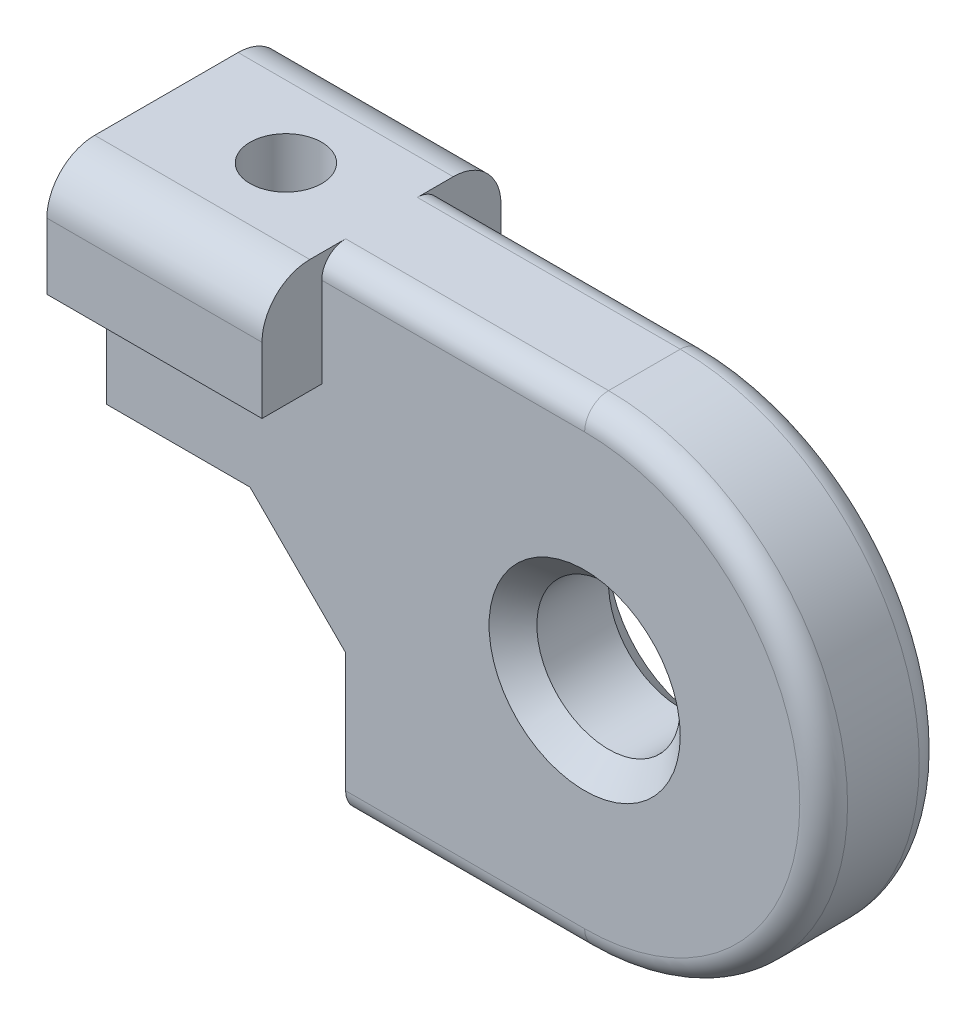
ISO-10303-21;
HEADER;
FILE_DESCRIPTION(('STEP AP214'),'2;1');
FILE_NAME('part.step','',(''),(''),'','','');
FILE_SCHEMA(('AUTOMOTIVE_DESIGN { 1 0 10303 214 1 1 1 1 }'));
ENDSEC;
DATA;
#1=APPLICATION_CONTEXT('core data for automotive mechanical design processes');
#2=APPLICATION_PROTOCOL_DEFINITION('international standard','automotive_design',2000,#1);
#3=PRODUCT_CONTEXT('',#1,'mechanical');
#4=PRODUCT('Part','Part','',(#3));
#5=PRODUCT_RELATED_PRODUCT_CATEGORY('part','',(#4));
#6=PRODUCT_DEFINITION_FORMATION('','',#4);
#7=PRODUCT_DEFINITION_CONTEXT('part definition',#1,'design');
#8=PRODUCT_DEFINITION('design','',#6,#7);
#9=PRODUCT_DEFINITION_SHAPE('','',#8);
#10=(LENGTH_UNIT() NAMED_UNIT(*) SI_UNIT(.MILLI.,.METRE.));
#11=(NAMED_UNIT(*) PLANE_ANGLE_UNIT() SI_UNIT($,.RADIAN.));
#12=(NAMED_UNIT(*) SI_UNIT($,.STERADIAN.) SOLID_ANGLE_UNIT());
#13=UNCERTAINTY_MEASURE_WITH_UNIT(LENGTH_MEASURE(1.E-05),#10,'distance_accuracy_value','');
#14=(GEOMETRIC_REPRESENTATION_CONTEXT(3) GLOBAL_UNCERTAINTY_ASSIGNED_CONTEXT((#13)) GLOBAL_UNIT_ASSIGNED_CONTEXT((#10,
#11,#12)) REPRESENTATION_CONTEXT('',''));
#15=CARTESIAN_POINT('',(0.,0.,0.));
#16=DIRECTION('',(0.,0.,1.));
#17=DIRECTION('',(1.,0.,0.));
#18=AXIS2_PLACEMENT_3D('',#15,#16,#17);
#19=CARTESIAN_POINT('',(0.,0.,2.5));
#20=DIRECTION('',(0.,0.,1.));
#21=DIRECTION('',(1.,0.,0.));
#22=AXIS2_PLACEMENT_3D('',#19,#20,#21);
#23=PLANE('',#22);
#24=DIRECTION('',(0.,-1.,0.));
#25=VECTOR('',#24,1.);
#26=CARTESIAN_POINT('',(-10.,-4.,2.5));
#27=LINE('',#26,#25);
#28=CARTESIAN_POINT('',(-10.,-4.,2.5));
#29=VERTEX_POINT('',#28);
#30=CARTESIAN_POINT('',(-10.,-9.,2.5));
#31=VERTEX_POINT('',#30);
#32=EDGE_CURVE('E297',#29,#31,#27,.T.);
#33=ORIENTED_EDGE('',*,*,#32,.T.);
#34=DIRECTION('',(1.,0.,0.));
#35=VECTOR('',#34,1.);
#36=CARTESIAN_POINT('',(0.,-9.,2.5));
#37=LINE('',#36,#35);
#38=CARTESIAN_POINT('',(0.,-9.,2.5));
#39=VERTEX_POINT('',#38);
#40=EDGE_CURVE('E247',#31,#39,#37,.T.);
#41=ORIENTED_EDGE('',*,*,#40,.T.);
#42=CARTESIAN_POINT('',(0.,0.,2.5));
#43=DIRECTION('',(0.,0.,1.));
#44=DIRECTION('',(1.,0.,0.));
#45=AXIS2_PLACEMENT_3D('',#42,#43,#44);
#46=CIRCLE('',#45,9.);
#47=CARTESIAN_POINT('',(0.,9.,2.5));
#48=VERTEX_POINT('',#47);
#49=EDGE_CURVE('E56',#39,#48,#46,.T.);
#50=ORIENTED_EDGE('',*,*,#49,.T.);
#51=DIRECTION('',(-1.,0.,0.));
#52=VECTOR('',#51,1.);
#53=CARTESIAN_POINT('',(-11.,9.,2.5));
#54=LINE('',#53,#52);
#55=CARTESIAN_POINT('',(-11.,9.,2.5));
#56=VERTEX_POINT('',#55);
#57=EDGE_CURVE('E245',#48,#56,#54,.T.);
#58=ORIENTED_EDGE('',*,*,#57,.T.);
#59=DIRECTION('',(0.,-1.,0.));
#60=VECTOR('',#59,1.);
#61=CARTESIAN_POINT('',(-11.,0.,2.5));
#62=LINE('',#61,#60);
#63=CARTESIAN_POINT('',(-11.,5.23809523809524,2.5));
#64=VERTEX_POINT('',#63);
#65=EDGE_CURVE('E275',#56,#64,#62,.T.);
#66=ORIENTED_EDGE('',*,*,#65,.T.);
#67=DIRECTION('',(-1.,0.,0.));
#68=VECTOR('',#67,1.);
#69=CARTESIAN_POINT('',(0.,5.23809523809524,2.5));
#70=LINE('',#69,#68);
#71=CARTESIAN_POINT('',(-20.,5.23809523809524,2.5));
#72=VERTEX_POINT('',#71);
#73=EDGE_CURVE('E289',#64,#72,#70,.T.);
#74=ORIENTED_EDGE('',*,*,#73,.T.);
#75=DIRECTION('',(0.,-1.,0.));
#76=VECTOR('',#75,1.);
#77=CARTESIAN_POINT('',(-20.,10.,2.5));
#78=LINE('',#77,#76);
#79=CARTESIAN_POINT('',(-20.,0.,2.5));
#80=VERTEX_POINT('',#79);
#81=EDGE_CURVE('E299',#72,#80,#78,.T.);
#82=ORIENTED_EDGE('',*,*,#81,.T.);
#83=DIRECTION('',(1.,0.,0.));
#84=VECTOR('',#83,1.);
#85=CARTESIAN_POINT('',(-20.,0.,2.5));
#86=LINE('',#85,#84);
#87=CARTESIAN_POINT('',(-14.,0.,2.5));
#88=VERTEX_POINT('',#87);
#89=EDGE_CURVE('E293',#80,#88,#86,.T.);
#90=ORIENTED_EDGE('',*,*,#89,.T.);
#91=DIRECTION('',(0.707106781186548,-0.707106781186548,0.));
#92=VECTOR('',#91,1.);
#93=CARTESIAN_POINT('',(-14.,0.,2.5));
#94=LINE('',#93,#92);
#95=EDGE_CURVE('E187',#88,#29,#94,.T.);
#96=ORIENTED_EDGE('',*,*,#95,.T.);
#97=EDGE_LOOP('',(#33,#41,#50,#58,#66,#74,#82,#90,#96));
#98=FACE_BOUND('',#97,.T.);
#99=CARTESIAN_POINT('',(0.,0.,2.5));
#100=DIRECTION('',(0.,0.,1.));
#101=DIRECTION('',(1.,0.,0.));
#102=AXIS2_PLACEMENT_3D('',#99,#100,#101);
#103=CIRCLE('',#102,4.00000000000001);
#104=CARTESIAN_POINT('',(4.00000000000001,0.,2.5));
#105=VERTEX_POINT('',#104);
#106=EDGE_CURVE('E221',#105,#105,#103,.F.);
#107=ORIENTED_EDGE('',*,*,#106,.T.);
#108=EDGE_LOOP('',(#107));
#109=FACE_BOUND('',#108,.T.);
#110=ADVANCED_FACE('F32',(#98,#109),#23,.T.);
#111=CARTESIAN_POINT('',(0.,0.,-2.5));
#112=DIRECTION('',(0.,0.,1.));
#113=DIRECTION('',(1.,0.,0.));
#114=AXIS2_PLACEMENT_3D('',#111,#112,#113);
#115=PLANE('',#114);
#116=CARTESIAN_POINT('',(0.,0.,-2.5));
#117=DIRECTION('',(0.,0.,1.));
#118=DIRECTION('',(1.,0.,0.));
#119=AXIS2_PLACEMENT_3D('',#116,#117,#118);
#120=CIRCLE('',#119,3.99999999999999);
#121=CARTESIAN_POINT('',(3.99999999999999,0.,-2.5));
#122=VERTEX_POINT('',#121);
#123=EDGE_CURVE('E212',#122,#122,#120,.T.);
#124=ORIENTED_EDGE('',*,*,#123,.T.);
#125=EDGE_LOOP('',(#124));
#126=FACE_BOUND('',#125,.T.);
#127=CARTESIAN_POINT('',(0.,0.,-2.5));
#128=DIRECTION('',(0.,0.,1.));
#129=DIRECTION('',(1.,0.,0.));
#130=AXIS2_PLACEMENT_3D('',#127,#128,#129);
#131=CIRCLE('',#130,9.);
#132=CARTESIAN_POINT('',(0.,9.,-2.5));
#133=VERTEX_POINT('',#132);
#134=CARTESIAN_POINT('',(0.,-9.,-2.5));
#135=VERTEX_POINT('',#134);
#136=EDGE_CURVE('E229',#133,#135,#131,.F.);
#137=ORIENTED_EDGE('',*,*,#136,.T.);
#138=DIRECTION('',(1.,0.,0.));
#139=VECTOR('',#138,1.);
#140=CARTESIAN_POINT('',(0.,-9.,-2.5));
#141=LINE('',#140,#139);
#142=CARTESIAN_POINT('',(-10.,-9.,-2.5));
#143=VERTEX_POINT('',#142);
#144=EDGE_CURVE('E233',#135,#143,#141,.F.);
#145=ORIENTED_EDGE('',*,*,#144,.T.);
#146=DIRECTION('',(0.,-1.,0.));
#147=VECTOR('',#146,1.);
#148=CARTESIAN_POINT('',(-10.,-4.,-2.5));
#149=LINE('',#148,#147);
#150=CARTESIAN_POINT('',(-10.,-4.,-2.5));
#151=VERTEX_POINT('',#150);
#152=EDGE_CURVE('E303',#151,#143,#149,.T.);
#153=ORIENTED_EDGE('',*,*,#152,.F.);
#154=DIRECTION('',(0.707106781186548,-0.707106781186548,0.));
#155=VECTOR('',#154,1.);
#156=CARTESIAN_POINT('',(-14.,0.,-2.5));
#157=LINE('',#156,#155);
#158=CARTESIAN_POINT('',(-14.,0.,-2.5));
#159=VERTEX_POINT('',#158);
#160=EDGE_CURVE('E287',#159,#151,#157,.T.);
#161=ORIENTED_EDGE('',*,*,#160,.F.);
#162=DIRECTION('',(1.,0.,0.));
#163=VECTOR('',#162,1.);
#164=CARTESIAN_POINT('',(-20.,0.,-2.5));
#165=LINE('',#164,#163);
#166=CARTESIAN_POINT('',(-20.,0.,-2.5));
#167=VERTEX_POINT('',#166);
#168=EDGE_CURVE('E284',#167,#159,#165,.T.);
#169=ORIENTED_EDGE('',*,*,#168,.F.);
#170=DIRECTION('',(0.,-1.,0.));
#171=VECTOR('',#170,1.);
#172=CARTESIAN_POINT('',(-20.,10.,-2.5));
#173=LINE('',#172,#171);
#174=CARTESIAN_POINT('',(-20.,5.23809523809524,-2.5));
#175=VERTEX_POINT('',#174);
#176=EDGE_CURVE('E295',#175,#167,#173,.T.);
#177=ORIENTED_EDGE('',*,*,#176,.F.);
#178=DIRECTION('',(-1.,0.,0.));
#179=VECTOR('',#178,1.);
#180=CARTESIAN_POINT('',(0.,5.23809523809524,-2.5));
#181=LINE('',#180,#179);
#182=CARTESIAN_POINT('',(-11.,5.23809523809524,-2.5));
#183=VERTEX_POINT('',#182);
#184=EDGE_CURVE('E361',#183,#175,#181,.T.);
#185=ORIENTED_EDGE('',*,*,#184,.F.);
#186=DIRECTION('',(0.,-1.,0.));
#187=VECTOR('',#186,1.);
#188=CARTESIAN_POINT('',(-11.,0.,-2.5));
#189=LINE('',#188,#187);
#190=CARTESIAN_POINT('',(-11.,9.,-2.5));
#191=VERTEX_POINT('',#190);
#192=EDGE_CURVE('E285',#191,#183,#189,.T.);
#193=ORIENTED_EDGE('',*,*,#192,.F.);
#194=DIRECTION('',(-1.,0.,0.));
#195=VECTOR('',#194,1.);
#196=CARTESIAN_POINT('',(0.,9.,-2.5));
#197=LINE('',#196,#195);
#198=EDGE_CURVE('E231',#191,#133,#197,.F.);
#199=ORIENTED_EDGE('',*,*,#198,.T.);
#200=EDGE_LOOP('',(#137,#145,#153,#161,#169,#177,#185,#193,#199));
#201=FACE_BOUND('',#200,.T.);
#202=ADVANCED_FACE('F330',(#126,#201),#115,.F.);
#203=CARTESIAN_POINT('',(-20.,0.,2.5));
#204=DIRECTION('',(0.,1.,0.));
#205=DIRECTION('',(0.,0.,1.));
#206=AXIS2_PLACEMENT_3D('',#203,#204,#205);
#207=PLANE('',#206);
#208=DIRECTION('',(0.,0.,-1.));
#209=VECTOR('',#208,1.);
#210=CARTESIAN_POINT('',(-14.,0.,2.5));
#211=LINE('',#210,#209);
#212=CARTESIAN_POINT('',(-14.,0.,-1.1180339887499));
#213=VERTEX_POINT('',#212);
#214=EDGE_CURVE('E182',#213,#159,#211,.T.);
#215=ORIENTED_EDGE('',*,*,#214,.F.);
#216=CARTESIAN_POINT('',(-15.,0.,0.));
#217=DIRECTION('',(0.,1.,0.));
#218=DIRECTION('',(0.,0.,1.));
#219=AXIS2_PLACEMENT_3D('',#216,#217,#218);
#220=CIRCLE('',#219,1.5);
#221=CARTESIAN_POINT('',(-14.,0.,1.1180339887499));
#222=VERTEX_POINT('',#221);
#223=EDGE_CURVE('E48',#213,#222,#220,.T.);
#224=ORIENTED_EDGE('',*,*,#223,.T.);
#225=EDGE_CURVE('E180',#88,#222,#211,.T.);
#226=ORIENTED_EDGE('',*,*,#225,.F.);
#227=ORIENTED_EDGE('',*,*,#89,.F.);
#228=DIRECTION('',(0.,0.,-1.));
#229=VECTOR('',#228,1.);
#230=CARTESIAN_POINT('',(-20.,0.,2.5));
#231=LINE('',#230,#229);
#232=EDGE_CURVE('E300',#80,#167,#231,.T.);
#233=ORIENTED_EDGE('',*,*,#232,.T.);
#234=ORIENTED_EDGE('',*,*,#168,.T.);
#235=EDGE_LOOP('',(#215,#224,#226,#227,#233,#234));
#236=FACE_BOUND('',#235,.T.);
#237=ADVANCED_FACE('F178',(#236),#207,.F.);
#238=CARTESIAN_POINT('',(-14.,0.,2.5));
#239=DIRECTION('',(0.707106781186548,0.707106781186548,0.));
#240=DIRECTION('',(-0.707106781186548,0.707106781186548,0.));
#241=AXIS2_PLACEMENT_3D('',#238,#239,#240);
#242=PLANE('',#241);
#243=ORIENTED_EDGE('',*,*,#225,.T.);
#244=CARTESIAN_POINT('',(-15.,0.999999999999999,0.));
#245=DIRECTION('',(0.707106781186548,0.707106781186548,0.));
#246=DIRECTION('',(-0.707106781186548,0.707106781186548,0.));
#247=AXIS2_PLACEMENT_3D('',#244,#245,#246);
#248=ELLIPSE('',#247,2.12132034355964,1.5);
#249=EDGE_CURVE('E169',#222,#213,#248,.T.);
#250=ORIENTED_EDGE('',*,*,#249,.T.);
#251=ORIENTED_EDGE('',*,*,#214,.T.);
#252=ORIENTED_EDGE('',*,*,#160,.T.);
#253=DIRECTION('',(0.,0.,-1.));
#254=VECTOR('',#253,1.);
#255=CARTESIAN_POINT('',(-10.,-4.,2.5));
#256=LINE('',#255,#254);
#257=EDGE_CURVE('E193',#29,#151,#256,.T.);
#258=ORIENTED_EDGE('',*,*,#257,.F.);
#259=ORIENTED_EDGE('',*,*,#95,.F.);
#260=EDGE_LOOP('',(#243,#250,#251,#252,#258,#259));
#261=FACE_BOUND('',#260,.T.);
#262=ADVANCED_FACE('F185',(#261),#242,.F.);
#263=CARTESIAN_POINT('',(-10.,-4.,2.5));
#264=DIRECTION('',(1.,0.,0.));
#265=DIRECTION('',(0.,0.,-1.));
#266=AXIS2_PLACEMENT_3D('',#263,#264,#265);
#267=PLANE('',#266);
#268=ORIENTED_EDGE('',*,*,#152,.T.);
#269=CARTESIAN_POINT('',(-10.,-9.,-1.5));
#270=DIRECTION('',(1.,0.,0.));
#271=DIRECTION('',(0.,0.,-1.));
#272=AXIS2_PLACEMENT_3D('',#269,#270,#271);
#273=CIRCLE('',#272,1.);
#274=CARTESIAN_POINT('',(-10.,-10.,-1.5));
#275=VERTEX_POINT('',#274);
#276=EDGE_CURVE('E237',#143,#275,#273,.F.);
#277=ORIENTED_EDGE('',*,*,#276,.T.);
#278=DIRECTION('',(0.,0.,-1.));
#279=VECTOR('',#278,1.);
#280=CARTESIAN_POINT('',(-10.,-10.,2.5));
#281=LINE('',#280,#279);
#282=CARTESIAN_POINT('',(-10.,-10.,1.5));
#283=VERTEX_POINT('',#282);
#284=EDGE_CURVE('E317',#283,#275,#281,.T.);
#285=ORIENTED_EDGE('',*,*,#284,.F.);
#286=CARTESIAN_POINT('',(-10.,-9.,1.5));
#287=DIRECTION('',(1.,0.,0.));
#288=DIRECTION('',(0.,0.,-1.));
#289=AXIS2_PLACEMENT_3D('',#286,#287,#288);
#290=CIRCLE('',#289,1.);
#291=EDGE_CURVE('E235',#283,#31,#290,.F.);
#292=ORIENTED_EDGE('',*,*,#291,.T.);
#293=ORIENTED_EDGE('',*,*,#32,.F.);
#294=ORIENTED_EDGE('',*,*,#257,.T.);
#295=EDGE_LOOP('',(#268,#277,#285,#292,#293,#294));
#296=FACE_BOUND('',#295,.T.);
#297=ADVANCED_FACE('F326',(#296),#267,.F.);
#298=CARTESIAN_POINT('',(-10.,-10.,2.5));
#299=DIRECTION('',(0.,1.,0.));
#300=DIRECTION('',(0.,0.,1.));
#301=AXIS2_PLACEMENT_3D('',#298,#299,#300);
#302=PLANE('',#301);
#303=ORIENTED_EDGE('',*,*,#284,.T.);
#304=DIRECTION('',(1.,0.,0.));
#305=VECTOR('',#304,1.);
#306=CARTESIAN_POINT('',(-10.,-10.,-1.5));
#307=LINE('',#306,#305);
#308=CARTESIAN_POINT('',(0.,-10.,-1.5));
#309=VERTEX_POINT('',#308);
#310=EDGE_CURVE('E226',#275,#309,#307,.T.);
#311=ORIENTED_EDGE('',*,*,#310,.T.);
#312=DIRECTION('',(0.,0.,-1.));
#313=VECTOR('',#312,1.);
#314=CARTESIAN_POINT('',(0.,-10.,2.5));
#315=LINE('',#314,#313);
#316=CARTESIAN_POINT('',(0.,-10.,1.5));
#317=VERTEX_POINT('',#316);
#318=EDGE_CURVE('E315',#317,#309,#315,.T.);
#319=ORIENTED_EDGE('',*,*,#318,.F.);
#320=DIRECTION('',(1.,0.,0.));
#321=VECTOR('',#320,1.);
#322=CARTESIAN_POINT('',(-10.,-10.,1.5));
#323=LINE('',#322,#321);
#324=EDGE_CURVE('E224',#317,#283,#323,.F.);
#325=ORIENTED_EDGE('',*,*,#324,.T.);
#326=EDGE_LOOP('',(#303,#311,#319,#325));
#327=FACE_BOUND('',#326,.T.);
#328=ADVANCED_FACE('F344',(#327),#302,.F.);
#329=CARTESIAN_POINT('',(0.,0.,2.5));
#330=DIRECTION('',(0.,0.,-1.));
#331=DIRECTION('',(-1.,0.,0.));
#332=AXIS2_PLACEMENT_3D('',#329,#330,#331);
#333=CYLINDRICAL_SURFACE('',#332,10.);
#334=ORIENTED_EDGE('',*,*,#318,.T.);
#335=CARTESIAN_POINT('',(0.,0.,-1.5));
#336=DIRECTION('',(0.,0.,1.));
#337=DIRECTION('',(1.,0.,0.));
#338=AXIS2_PLACEMENT_3D('',#335,#336,#337);
#339=CIRCLE('',#338,10.);
#340=CARTESIAN_POINT('',(0.,10.,-1.5));
#341=VERTEX_POINT('',#340);
#342=EDGE_CURVE('E251',#309,#341,#339,.T.);
#343=ORIENTED_EDGE('',*,*,#342,.T.);
#344=DIRECTION('',(0.,0.,-1.));
#345=VECTOR('',#344,1.);
#346=CARTESIAN_POINT('',(0.,10.,2.5));
#347=LINE('',#346,#345);
#348=CARTESIAN_POINT('',(0.,10.,1.5));
#349=VERTEX_POINT('',#348);
#350=EDGE_CURVE('E312',#349,#341,#347,.T.);
#351=ORIENTED_EDGE('',*,*,#350,.F.);
#352=CARTESIAN_POINT('',(0.,0.,1.5));
#353=DIRECTION('',(0.,0.,1.));
#354=DIRECTION('',(1.,0.,0.));
#355=AXIS2_PLACEMENT_3D('',#352,#353,#354);
#356=CIRCLE('',#355,10.);
#357=EDGE_CURVE('E249',#349,#317,#356,.F.);
#358=ORIENTED_EDGE('',*,*,#357,.T.);
#359=EDGE_LOOP('',(#334,#343,#351,#358));
#360=FACE_BOUND('',#359,.T.);
#361=ADVANCED_FACE('F345',(#360),#333,.T.);
#362=CARTESIAN_POINT('',(0.,10.,2.5));
#363=DIRECTION('',(0.,-1.,0.));
#364=DIRECTION('',(0.,0.,-1.));
#365=AXIS2_PLACEMENT_3D('',#362,#363,#364);
#366=PLANE('',#365);
#367=CARTESIAN_POINT('',(-15.,10.,0.));
#368=DIRECTION('',(0.,1.,0.));
#369=DIRECTION('',(0.,0.,1.));
#370=AXIS2_PLACEMENT_3D('',#367,#368,#369);
#371=CIRCLE('',#370,1.5);
#372=CARTESIAN_POINT('',(-15.,10.,1.5));
#373=VERTEX_POINT('',#372);
#374=EDGE_CURVE('E174',#373,#373,#371,.T.);
#375=ORIENTED_EDGE('',*,*,#374,.F.);
#376=EDGE_LOOP('',(#375));
#377=FACE_BOUND('',#376,.T.);
#378=ORIENTED_EDGE('',*,*,#350,.T.);
#379=DIRECTION('',(-1.,0.,0.));
#380=VECTOR('',#379,1.);
#381=CARTESIAN_POINT('',(0.,10.,-1.5));
#382=LINE('',#381,#380);
#383=CARTESIAN_POINT('',(-11.,10.,-1.5));
#384=VERTEX_POINT('',#383);
#385=EDGE_CURVE('E241',#341,#384,#382,.T.);
#386=ORIENTED_EDGE('',*,*,#385,.T.);
#387=DIRECTION('',(0.,0.,-1.));
#388=VECTOR('',#387,1.);
#389=CARTESIAN_POINT('',(-11.,10.,5.));
#390=LINE('',#389,#388);
#391=CARTESIAN_POINT('',(-11.,10.,-3.));
#392=VERTEX_POINT('',#391);
#393=EDGE_CURVE('E359',#384,#392,#390,.T.);
#394=ORIENTED_EDGE('',*,*,#393,.T.);
#395=DIRECTION('',(-1.,0.,0.));
#396=VECTOR('',#395,1.);
#397=CARTESIAN_POINT('',(0.,10.,-3.));
#398=LINE('',#397,#396);
#399=CARTESIAN_POINT('',(-20.,10.,-3.));
#400=VERTEX_POINT('',#399);
#401=EDGE_CURVE('E191',#392,#400,#398,.T.);
#402=ORIENTED_EDGE('',*,*,#401,.T.);
#403=DIRECTION('',(0.,0.,-1.));
#404=VECTOR('',#403,1.);
#405=CARTESIAN_POINT('',(-20.,10.,2.5));
#406=LINE('',#405,#404);
#407=CARTESIAN_POINT('',(-20.,10.,3.));
#408=VERTEX_POINT('',#407);
#409=EDGE_CURVE('E309',#408,#400,#406,.T.);
#410=ORIENTED_EDGE('',*,*,#409,.F.);
#411=DIRECTION('',(-1.,0.,0.));
#412=VECTOR('',#411,1.);
#413=CARTESIAN_POINT('',(-11.,10.,3.));
#414=LINE('',#413,#412);
#415=CARTESIAN_POINT('',(-11.,10.,3.));
#416=VERTEX_POINT('',#415);
#417=EDGE_CURVE('E189',#408,#416,#414,.F.);
#418=ORIENTED_EDGE('',*,*,#417,.T.);
#419=CARTESIAN_POINT('',(-11.,10.,1.5));
#420=VERTEX_POINT('',#419);
#421=EDGE_CURVE('E374',#416,#420,#390,.T.);
#422=ORIENTED_EDGE('',*,*,#421,.T.);
#423=DIRECTION('',(-1.,0.,0.));
#424=VECTOR('',#423,1.);
#425=CARTESIAN_POINT('',(0.,10.,1.5));
#426=LINE('',#425,#424);
#427=EDGE_CURVE('E239',#420,#349,#426,.F.);
#428=ORIENTED_EDGE('',*,*,#427,.T.);
#429=EDGE_LOOP('',(#378,#386,#394,#402,#410,#418,#422,#428));
#430=FACE_BOUND('',#429,.T.);
#431=ADVANCED_FACE('F348',(#377,#430),#366,.F.);
#432=CARTESIAN_POINT('',(-20.,10.,2.5));
#433=DIRECTION('',(1.,0.,0.));
#434=DIRECTION('',(0.,0.,-1.));
#435=AXIS2_PLACEMENT_3D('',#432,#433,#434);
#436=PLANE('',#435);
#437=ORIENTED_EDGE('',*,*,#409,.T.);
#438=CARTESIAN_POINT('',(-20.,8.,-3.));
#439=DIRECTION('',(1.,0.,0.));
#440=DIRECTION('',(0.,0.,-1.));
#441=AXIS2_PLACEMENT_3D('',#438,#439,#440);
#442=CIRCLE('',#441,2.);
#443=CARTESIAN_POINT('',(-20.,8.,-5.));
#444=VERTEX_POINT('',#443);
#445=EDGE_CURVE('E201',#400,#444,#442,.F.);
#446=ORIENTED_EDGE('',*,*,#445,.T.);
#447=DIRECTION('',(0.,-1.,0.));
#448=VECTOR('',#447,1.);
#449=CARTESIAN_POINT('',(-20.,10.,-5.));
#450=LINE('',#449,#448);
#451=CARTESIAN_POINT('',(-20.,5.23809523809524,-5.));
#452=VERTEX_POINT('',#451);
#453=EDGE_CURVE('E258',#444,#452,#450,.T.);
#454=ORIENTED_EDGE('',*,*,#453,.T.);
#455=DIRECTION('',(0.,0.,-1.));
#456=VECTOR('',#455,1.);
#457=CARTESIAN_POINT('',(-20.,5.23809523809524,5.));
#458=LINE('',#457,#456);
#459=EDGE_CURVE('E376',#175,#452,#458,.T.);
#460=ORIENTED_EDGE('',*,*,#459,.F.);
#461=ORIENTED_EDGE('',*,*,#176,.T.);
#462=ORIENTED_EDGE('',*,*,#232,.F.);
#463=ORIENTED_EDGE('',*,*,#81,.F.);
#464=CARTESIAN_POINT('',(-20.,5.23809523809524,5.));
#465=VERTEX_POINT('',#464);
#466=EDGE_CURVE('E366',#465,#72,#458,.T.);
#467=ORIENTED_EDGE('',*,*,#466,.F.);
#468=DIRECTION('',(0.,-1.,0.));
#469=VECTOR('',#468,1.);
#470=CARTESIAN_POINT('',(-20.,10.,5.));
#471=LINE('',#470,#469);
#472=CARTESIAN_POINT('',(-20.,8.,5.));
#473=VERTEX_POINT('',#472);
#474=EDGE_CURVE('E634',#473,#465,#471,.T.);
#475=ORIENTED_EDGE('',*,*,#474,.F.);
#476=CARTESIAN_POINT('',(-20.,8.,3.));
#477=DIRECTION('',(1.,0.,0.));
#478=DIRECTION('',(0.,0.,-1.));
#479=AXIS2_PLACEMENT_3D('',#476,#477,#478);
#480=CIRCLE('',#479,2.);
#481=EDGE_CURVE('E199',#473,#408,#480,.F.);
#482=ORIENTED_EDGE('',*,*,#481,.T.);
#483=EDGE_LOOP('',(#437,#446,#454,#460,#461,#462,#463,#467,#475,#482));
#484=FACE_BOUND('',#483,.T.);
#485=ADVANCED_FACE('F385',(#484),#436,.F.);
#486=CARTESIAN_POINT('',(0.,0.,2.5));
#487=DIRECTION('',(0.,0.,-1.));
#488=DIRECTION('',(-1.,0.,0.));
#489=AXIS2_PLACEMENT_3D('',#486,#487,#488);
#490=CYLINDRICAL_SURFACE('',#489,3.);
#491=CARTESIAN_POINT('',(0.,0.,-1.5));
#492=DIRECTION('',(0.,0.,1.));
#493=DIRECTION('',(1.,0.,0.));
#494=AXIS2_PLACEMENT_3D('',#491,#492,#493);
#495=CIRCLE('',#494,3.);
#496=CARTESIAN_POINT('',(3.,0.,-1.5));
#497=VERTEX_POINT('',#496);
#498=EDGE_CURVE('E218',#497,#497,#495,.F.);
#499=ORIENTED_EDGE('',*,*,#498,.T.);
#500=EDGE_LOOP('',(#499));
#501=FACE_BOUND('',#500,.T.);
#502=CARTESIAN_POINT('',(0.,0.,1.5));
#503=DIRECTION('',(0.,0.,1.));
#504=DIRECTION('',(1.,0.,0.));
#505=AXIS2_PLACEMENT_3D('',#502,#503,#504);
#506=CIRCLE('',#505,3.);
#507=CARTESIAN_POINT('',(3.,0.,1.5));
#508=VERTEX_POINT('',#507);
#509=EDGE_CURVE('E215',#508,#508,#506,.T.);
#510=ORIENTED_EDGE('',*,*,#509,.T.);
#511=EDGE_LOOP('',(#510));
#512=FACE_BOUND('',#511,.T.);
#513=ADVANCED_FACE('F407',(#501,#512),#490,.F.);
#514=CARTESIAN_POINT('',(0.,0.,-5.));
#515=DIRECTION('',(0.,0.,1.));
#516=DIRECTION('',(1.,0.,0.));
#517=AXIS2_PLACEMENT_3D('',#514,#515,#516);
#518=PLANE('',#517);
#519=ORIENTED_EDGE('',*,*,#453,.F.);
#520=DIRECTION('',(-1.,0.,0.));
#521=VECTOR('',#520,1.);
#522=CARTESIAN_POINT('',(0.,8.,-5.));
#523=LINE('',#522,#521);
#524=CARTESIAN_POINT('',(-11.,8.,-5.));
#525=VERTEX_POINT('',#524);
#526=EDGE_CURVE('E203',#444,#525,#523,.F.);
#527=ORIENTED_EDGE('',*,*,#526,.T.);
#528=DIRECTION('',(0.,1.,0.));
#529=VECTOR('',#528,1.);
#530=CARTESIAN_POINT('',(-11.,5.23809523809524,-5.));
#531=LINE('',#530,#529);
#532=CARTESIAN_POINT('',(-11.,5.23809523809524,-5.));
#533=VERTEX_POINT('',#532);
#534=EDGE_CURVE('E640',#533,#525,#531,.T.);
#535=ORIENTED_EDGE('',*,*,#534,.F.);
#536=DIRECTION('',(1.,0.,0.));
#537=VECTOR('',#536,1.);
#538=CARTESIAN_POINT('',(-20.,5.23809523809524,-5.));
#539=LINE('',#538,#537);
#540=EDGE_CURVE('E372',#452,#533,#539,.T.);
#541=ORIENTED_EDGE('',*,*,#540,.F.);
#542=EDGE_LOOP('',(#519,#527,#535,#541));
#543=FACE_BOUND('',#542,.T.);
#544=ADVANCED_FACE('F515',(#543),#518,.F.);
#545=CARTESIAN_POINT('',(-11.,5.23809523809524,5.));
#546=DIRECTION('',(-1.,0.,0.));
#547=DIRECTION('',(0.,0.,1.));
#548=AXIS2_PLACEMENT_3D('',#545,#546,#547);
#549=PLANE('',#548);
#550=ORIENTED_EDGE('',*,*,#534,.T.);
#551=CARTESIAN_POINT('',(-11.,8.,-3.));
#552=DIRECTION('',(-1.,0.,0.));
#553=DIRECTION('',(0.,0.,1.));
#554=AXIS2_PLACEMENT_3D('',#551,#552,#553);
#555=CIRCLE('',#554,2.);
#556=EDGE_CURVE('E205',#525,#392,#555,.F.);
#557=ORIENTED_EDGE('',*,*,#556,.T.);
#558=ORIENTED_EDGE('',*,*,#393,.F.);
#559=CARTESIAN_POINT('',(-11.,9.,-1.5));
#560=DIRECTION('',(-1.,0.,0.));
#561=DIRECTION('',(0.,0.,1.));
#562=AXIS2_PLACEMENT_3D('',#559,#560,#561);
#563=CIRCLE('',#562,1.);
#564=EDGE_CURVE('E41',#384,#191,#563,.T.);
#565=ORIENTED_EDGE('',*,*,#564,.T.);
#566=ORIENTED_EDGE('',*,*,#192,.T.);
#567=DIRECTION('',(0.,0.,-1.));
#568=VECTOR('',#567,1.);
#569=CARTESIAN_POINT('',(-11.,5.23809523809524,5.));
#570=LINE('',#569,#568);
#571=EDGE_CURVE('E369',#183,#533,#570,.T.);
#572=ORIENTED_EDGE('',*,*,#571,.T.);
#573=EDGE_LOOP('',(#550,#557,#558,#565,#566,#572));
#574=FACE_BOUND('',#573,.T.);
#575=ADVANCED_FACE('F357',(#574),#549,.F.);
#576=CARTESIAN_POINT('',(-20.,5.23809523809524,5.));
#577=DIRECTION('',(0.,1.,0.));
#578=DIRECTION('',(0.,0.,1.));
#579=AXIS2_PLACEMENT_3D('',#576,#577,#578);
#580=PLANE('',#579);
#581=ORIENTED_EDGE('',*,*,#571,.F.);
#582=ORIENTED_EDGE('',*,*,#184,.T.);
#583=ORIENTED_EDGE('',*,*,#459,.T.);
#584=ORIENTED_EDGE('',*,*,#540,.T.);
#585=EDGE_LOOP('',(#581,#582,#583,#584));
#586=FACE_BOUND('',#585,.T.);
#587=ADVANCED_FACE('F370',(#586),#580,.F.);
#588=ORIENTED_EDGE('',*,*,#73,.F.);
#589=CARTESIAN_POINT('',(-11.,5.23809523809524,5.));
#590=VERTEX_POINT('',#589);
#591=EDGE_CURVE('E282',#590,#64,#570,.T.);
#592=ORIENTED_EDGE('',*,*,#591,.F.);
#593=DIRECTION('',(1.,0.,0.));
#594=VECTOR('',#593,1.);
#595=CARTESIAN_POINT('',(-20.,5.23809523809524,5.));
#596=LINE('',#595,#594);
#597=EDGE_CURVE('E629',#465,#590,#596,.T.);
#598=ORIENTED_EDGE('',*,*,#597,.F.);
#599=ORIENTED_EDGE('',*,*,#466,.T.);
#600=EDGE_LOOP('',(#588,#592,#598,#599));
#601=FACE_BOUND('',#600,.T.);
#602=ADVANCED_FACE('F537',(#601),#580,.F.);
#603=ORIENTED_EDGE('',*,*,#421,.F.);
#604=CARTESIAN_POINT('',(-11.,8.,3.));
#605=DIRECTION('',(-1.,0.,0.));
#606=DIRECTION('',(0.,0.,1.));
#607=AXIS2_PLACEMENT_3D('',#604,#605,#606);
#608=CIRCLE('',#607,2.);
#609=CARTESIAN_POINT('',(-11.,8.,5.));
#610=VERTEX_POINT('',#609);
#611=EDGE_CURVE('E210',#416,#610,#608,.F.);
#612=ORIENTED_EDGE('',*,*,#611,.T.);
#613=DIRECTION('',(0.,1.,0.));
#614=VECTOR('',#613,1.);
#615=CARTESIAN_POINT('',(-11.,5.23809523809524,5.));
#616=LINE('',#615,#614);
#617=EDGE_CURVE('E627',#590,#610,#616,.T.);
#618=ORIENTED_EDGE('',*,*,#617,.F.);
#619=ORIENTED_EDGE('',*,*,#591,.T.);
#620=ORIENTED_EDGE('',*,*,#65,.F.);
#621=CARTESIAN_POINT('',(-11.,9.,1.5));
#622=DIRECTION('',(-1.,0.,0.));
#623=DIRECTION('',(0.,0.,1.));
#624=AXIS2_PLACEMENT_3D('',#621,#622,#623);
#625=CIRCLE('',#624,1.);
#626=EDGE_CURVE('E11',#56,#420,#625,.T.);
#627=ORIENTED_EDGE('',*,*,#626,.T.);
#628=EDGE_LOOP('',(#603,#612,#618,#619,#620,#627));
#629=FACE_BOUND('',#628,.T.);
#630=ADVANCED_FACE('F279',(#629),#549,.F.);
#631=CARTESIAN_POINT('',(0.,0.,5.));
#632=DIRECTION('',(0.,0.,1.));
#633=DIRECTION('',(1.,0.,0.));
#634=AXIS2_PLACEMENT_3D('',#631,#632,#633);
#635=PLANE('',#634);
#636=ORIENTED_EDGE('',*,*,#617,.T.);
#637=DIRECTION('',(-1.,0.,0.));
#638=VECTOR('',#637,1.);
#639=CARTESIAN_POINT('',(-20.,8.,5.));
#640=LINE('',#639,#638);
#641=EDGE_CURVE('E207',#610,#473,#640,.T.);
#642=ORIENTED_EDGE('',*,*,#641,.T.);
#643=ORIENTED_EDGE('',*,*,#474,.T.);
#644=ORIENTED_EDGE('',*,*,#597,.T.);
#645=EDGE_LOOP('',(#636,#642,#643,#644));
#646=FACE_BOUND('',#645,.T.);
#647=ADVANCED_FACE('F429',(#646),#635,.T.);
#648=CARTESIAN_POINT('',(0.,8.,-3.));
#649=DIRECTION('',(-1.,0.,0.));
#650=DIRECTION('',(0.,0.,1.));
#651=AXIS2_PLACEMENT_3D('',#648,#649,#650);
#652=CYLINDRICAL_SURFACE('',#651,2.);
#653=ORIENTED_EDGE('',*,*,#556,.F.);
#654=ORIENTED_EDGE('',*,*,#526,.F.);
#655=ORIENTED_EDGE('',*,*,#445,.F.);
#656=ORIENTED_EDGE('',*,*,#401,.F.);
#657=EDGE_LOOP('',(#653,#654,#655,#656));
#658=FACE_BOUND('',#657,.T.);
#659=ADVANCED_FACE('F425',(#658),#652,.T.);
#660=CARTESIAN_POINT('',(0.,8.,3.));
#661=DIRECTION('',(1.,0.,0.));
#662=DIRECTION('',(0.,0.,-1.));
#663=AXIS2_PLACEMENT_3D('',#660,#661,#662);
#664=CYLINDRICAL_SURFACE('',#663,2.);
#665=ORIENTED_EDGE('',*,*,#611,.F.);
#666=ORIENTED_EDGE('',*,*,#417,.F.);
#667=ORIENTED_EDGE('',*,*,#481,.F.);
#668=ORIENTED_EDGE('',*,*,#641,.F.);
#669=EDGE_LOOP('',(#665,#666,#667,#668));
#670=FACE_BOUND('',#669,.T.);
#671=ADVANCED_FACE('F428',(#670),#664,.T.);
#672=CARTESIAN_POINT('',(0.,0.,-2.5));
#673=DIRECTION('',(0.,0.,-1.));
#674=DIRECTION('',(-1.,0.,0.));
#675=AXIS2_PLACEMENT_3D('',#672,#673,#674);
#676=CONICAL_SURFACE('',#675,3.99999999999999,0.785398163397447);
#677=ORIENTED_EDGE('',*,*,#498,.F.);
#678=EDGE_LOOP('',(#677));
#679=FACE_BOUND('',#678,.T.);
#680=ORIENTED_EDGE('',*,*,#123,.F.);
#681=EDGE_LOOP('',(#680));
#682=FACE_BOUND('',#681,.T.);
#683=ADVANCED_FACE('F433',(#679,#682),#676,.F.);
#684=CARTESIAN_POINT('',(0.,0.,1.5));
#685=DIRECTION('',(0.,0.,1.));
#686=DIRECTION('',(1.,0.,0.));
#687=AXIS2_PLACEMENT_3D('',#684,#685,#686);
#688=CONICAL_SURFACE('',#687,3.,0.785398163397451);
#689=ORIENTED_EDGE('',*,*,#106,.F.);
#690=EDGE_LOOP('',(#689));
#691=FACE_BOUND('',#690,.T.);
#692=ORIENTED_EDGE('',*,*,#509,.F.);
#693=EDGE_LOOP('',(#692));
#694=FACE_BOUND('',#693,.T.);
#695=ADVANCED_FACE('F437',(#691,#694),#688,.F.);
#696=CARTESIAN_POINT('',(0.,9.,-1.5));
#697=DIRECTION('',(-1.,0.,0.));
#698=DIRECTION('',(0.,0.,1.));
#699=AXIS2_PLACEMENT_3D('',#696,#697,#698);
#700=CYLINDRICAL_SURFACE('',#699,1.);
#701=ORIENTED_EDGE('',*,*,#564,.F.);
#702=ORIENTED_EDGE('',*,*,#385,.F.);
#703=CARTESIAN_POINT('',(0.,9.,-1.5));
#704=DIRECTION('',(1.,0.,0.));
#705=DIRECTION('',(0.,0.,-1.));
#706=AXIS2_PLACEMENT_3D('',#703,#704,#705);
#707=CIRCLE('',#706,1.);
#708=EDGE_CURVE('E256',#133,#341,#707,.T.);
#709=ORIENTED_EDGE('',*,*,#708,.F.);
#710=ORIENTED_EDGE('',*,*,#198,.F.);
#711=EDGE_LOOP('',(#701,#702,#709,#710));
#712=FACE_BOUND('',#711,.T.);
#713=ADVANCED_FACE('F352',(#712),#700,.T.);
#714=CARTESIAN_POINT('',(0.,0.,-1.5));
#715=DIRECTION('',(0.,0.,1.));
#716=DIRECTION('',(1.,0.,0.));
#717=AXIS2_PLACEMENT_3D('',#714,#715,#716);
#718=TOROIDAL_SURFACE('',#717,9.,1.);
#719=ORIENTED_EDGE('',*,*,#708,.T.);
#720=ORIENTED_EDGE('',*,*,#342,.F.);
#721=CARTESIAN_POINT('',(0.,-9.,-1.5));
#722=DIRECTION('',(-1.,0.,0.));
#723=DIRECTION('',(0.,0.,1.));
#724=AXIS2_PLACEMENT_3D('',#721,#722,#723);
#725=CIRCLE('',#724,1.);
#726=EDGE_CURVE('E254',#135,#309,#725,.T.);
#727=ORIENTED_EDGE('',*,*,#726,.F.);
#728=ORIENTED_EDGE('',*,*,#136,.F.);
#729=EDGE_LOOP('',(#719,#720,#727,#728));
#730=FACE_BOUND('',#729,.T.);
#731=ADVANCED_FACE('F339',(#730),#718,.T.);
#732=CARTESIAN_POINT('',(-10.,-9.,-1.5));
#733=DIRECTION('',(1.,0.,0.));
#734=DIRECTION('',(0.,0.,-1.));
#735=AXIS2_PLACEMENT_3D('',#732,#733,#734);
#736=CYLINDRICAL_SURFACE('',#735,1.);
#737=ORIENTED_EDGE('',*,*,#276,.F.);
#738=ORIENTED_EDGE('',*,*,#144,.F.);
#739=ORIENTED_EDGE('',*,*,#726,.T.);
#740=ORIENTED_EDGE('',*,*,#310,.F.);
#741=EDGE_LOOP('',(#737,#738,#739,#740));
#742=FACE_BOUND('',#741,.T.);
#743=ADVANCED_FACE('F336',(#742),#736,.T.);
#744=CARTESIAN_POINT('',(0.,9.,1.5));
#745=DIRECTION('',(1.,0.,0.));
#746=DIRECTION('',(0.,0.,-1.));
#747=AXIS2_PLACEMENT_3D('',#744,#745,#746);
#748=CYLINDRICAL_SURFACE('',#747,1.);
#749=ORIENTED_EDGE('',*,*,#626,.F.);
#750=ORIENTED_EDGE('',*,*,#57,.F.);
#751=CARTESIAN_POINT('',(0.,9.,1.5));
#752=DIRECTION('',(1.,0.,0.));
#753=DIRECTION('',(0.,0.,-1.));
#754=AXIS2_PLACEMENT_3D('',#751,#752,#753);
#755=CIRCLE('',#754,1.);
#756=EDGE_CURVE('E36',#349,#48,#755,.T.);
#757=ORIENTED_EDGE('',*,*,#756,.F.);
#758=ORIENTED_EDGE('',*,*,#427,.F.);
#759=EDGE_LOOP('',(#749,#750,#757,#758));
#760=FACE_BOUND('',#759,.T.);
#761=ADVANCED_FACE('F34',(#760),#748,.T.);
#762=CARTESIAN_POINT('',(0.,0.,1.5));
#763=DIRECTION('',(0.,0.,1.));
#764=DIRECTION('',(1.,0.,0.));
#765=AXIS2_PLACEMENT_3D('',#762,#763,#764);
#766=TOROIDAL_SURFACE('',#765,9.,1.);
#767=ORIENTED_EDGE('',*,*,#756,.T.);
#768=ORIENTED_EDGE('',*,*,#49,.F.);
#769=CARTESIAN_POINT('',(0.,-9.,1.5));
#770=DIRECTION('',(-1.,0.,0.));
#771=DIRECTION('',(0.,-1.,0.));
#772=AXIS2_PLACEMENT_3D('',#769,#770,#771);
#773=CIRCLE('',#772,1.);
#774=EDGE_CURVE('E183',#317,#39,#773,.T.);
#775=ORIENTED_EDGE('',*,*,#774,.F.);
#776=ORIENTED_EDGE('',*,*,#357,.F.);
#777=EDGE_LOOP('',(#767,#768,#775,#776));
#778=FACE_BOUND('',#777,.T.);
#779=ADVANCED_FACE('F267',(#778),#766,.T.);
#780=CARTESIAN_POINT('',(0.,-9.,1.5));
#781=DIRECTION('',(-1.,0.,0.));
#782=DIRECTION('',(0.,0.,1.));
#783=AXIS2_PLACEMENT_3D('',#780,#781,#782);
#784=CYLINDRICAL_SURFACE('',#783,1.);
#785=ORIENTED_EDGE('',*,*,#291,.F.);
#786=ORIENTED_EDGE('',*,*,#324,.F.);
#787=ORIENTED_EDGE('',*,*,#774,.T.);
#788=ORIENTED_EDGE('',*,*,#40,.F.);
#789=EDGE_LOOP('',(#785,#786,#787,#788));
#790=FACE_BOUND('',#789,.T.);
#791=ADVANCED_FACE('F389',(#790),#784,.T.);
#792=CARTESIAN_POINT('',(-15.,-10.,0.));
#793=DIRECTION('',(0.,1.,0.));
#794=DIRECTION('',(0.,0.,1.));
#795=AXIS2_PLACEMENT_3D('',#792,#793,#794);
#796=CYLINDRICAL_SURFACE('',#795,1.5);
#797=ORIENTED_EDGE('',*,*,#374,.T.);
#798=EDGE_LOOP('',(#797));
#799=FACE_BOUND('',#798,.T.);
#800=ORIENTED_EDGE('',*,*,#249,.F.);
#801=ORIENTED_EDGE('',*,*,#223,.F.);
#802=EDGE_LOOP('',(#800,#801));
#803=FACE_BOUND('',#802,.T.);
#804=ADVANCED_FACE('F170',(#799,#803),#796,.F.);
#805=CLOSED_SHELL('',(#110,#202,#237,#262,#297,#328,#361,#431,#485,#513,#544,#575,#587,#602,
#630,#647,#659,#671,#683,#695,#713,#731,#743,#761,#779,#791,#804));
#806=MANIFOLD_SOLID_BREP('B2',#805);
#807=ADVANCED_BREP_SHAPE_REPRESENTATION('',(#18,#806),#14);
#808=SHAPE_DEFINITION_REPRESENTATION(#9,#807);
ENDSEC;
END-ISO-10303-21;
